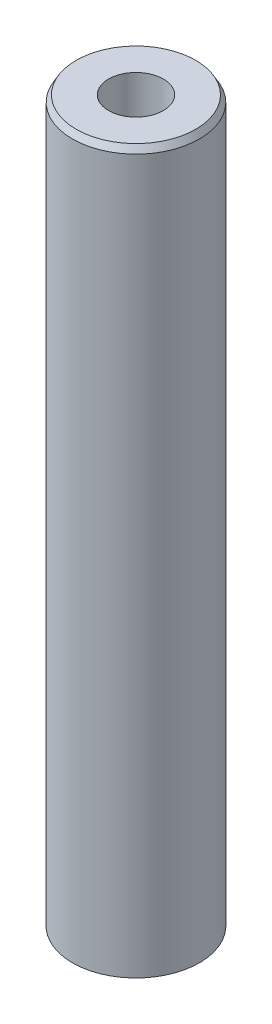
ISO-10303-21;
HEADER;
FILE_DESCRIPTION(('STEP AP214'),'2;1');
FILE_NAME('part.step','',(''),(''),'','','');
FILE_SCHEMA(('AUTOMOTIVE_DESIGN { 1 0 10303 214 1 1 1 1 }'));
ENDSEC;
DATA;
#1=APPLICATION_CONTEXT('core data for automotive mechanical design processes');
#2=APPLICATION_PROTOCOL_DEFINITION('international standard','automotive_design',2000,#1);
#3=PRODUCT_CONTEXT('',#1,'mechanical');
#4=PRODUCT('Part','Part','',(#3));
#5=PRODUCT_RELATED_PRODUCT_CATEGORY('part','',(#4));
#6=PRODUCT_DEFINITION_FORMATION('','',#4);
#7=PRODUCT_DEFINITION_CONTEXT('part definition',#1,'design');
#8=PRODUCT_DEFINITION('design','',#6,#7);
#9=PRODUCT_DEFINITION_SHAPE('','',#8);
#10=(LENGTH_UNIT() NAMED_UNIT(*) SI_UNIT(.MILLI.,.METRE.));
#11=(NAMED_UNIT(*) PLANE_ANGLE_UNIT() SI_UNIT($,.RADIAN.));
#12=(NAMED_UNIT(*) SI_UNIT($,.STERADIAN.) SOLID_ANGLE_UNIT());
#13=UNCERTAINTY_MEASURE_WITH_UNIT(LENGTH_MEASURE(1.E-05),#10,'distance_accuracy_value','');
#14=(GEOMETRIC_REPRESENTATION_CONTEXT(3) GLOBAL_UNCERTAINTY_ASSIGNED_CONTEXT((#13)) GLOBAL_UNIT_ASSIGNED_CONTEXT((#10,
#11,#12)) REPRESENTATION_CONTEXT('',''));
#15=CARTESIAN_POINT('',(0.,0.,0.));
#16=DIRECTION('',(0.,0.,1.));
#17=DIRECTION('',(1.,0.,0.));
#18=AXIS2_PLACEMENT_3D('',#15,#16,#17);
#19=CARTESIAN_POINT('',(0.,541.152869145942,0.));
#20=DIRECTION('',(0.,-1.,0.));
#21=DIRECTION('',(0.,0.,-1.));
#22=AXIS2_PLACEMENT_3D('',#19,#20,#21);
#23=CYLINDRICAL_SURFACE('',#22,47.5);
#24=CARTESIAN_POINT('',(0.,536.290267975968,0.));
#25=DIRECTION('',(0.,1.,0.));
#26=DIRECTION('',(0.,0.,1.));
#27=AXIS2_PLACEMENT_3D('',#24,#25,#26);
#28=CIRCLE('',#27,47.5);
#29=CARTESIAN_POINT('',(0.,536.290267975968,47.5));
#30=VERTEX_POINT('',#29);
#31=EDGE_CURVE('E50',#30,#30,#28,.F.);
#32=ORIENTED_EDGE('',*,*,#31,.T.);
#33=EDGE_LOOP('',(#32));
#34=FACE_BOUND('',#33,.T.);
#35=CARTESIAN_POINT('',(0.,2.80742409444645,0.));
#36=DIRECTION('',(0.,1.,0.));
#37=DIRECTION('',(0.,0.,1.));
#38=AXIS2_PLACEMENT_3D('',#35,#36,#37);
#39=CIRCLE('',#38,47.5);
#40=CARTESIAN_POINT('',(0.,2.80742409444645,47.5));
#41=VERTEX_POINT('',#40);
#42=EDGE_CURVE('E51',#41,#41,#39,.T.);
#43=ORIENTED_EDGE('',*,*,#42,.T.);
#44=EDGE_LOOP('',(#43));
#45=FACE_BOUND('',#44,.T.);
#46=ADVANCED_FACE('F39',(#34,#45),#23,.T.);
#47=CARTESIAN_POINT('',(0.,541.152869145942,0.));
#48=DIRECTION('',(0.,1.,0.));
#49=DIRECTION('',(0.,0.,1.));
#50=AXIS2_PLACEMENT_3D('',#47,#48,#49);
#51=PLANE('',#50);
#52=CARTESIAN_POINT('',(0.,541.152869145942,0.));
#53=DIRECTION('',(0.,1.,0.));
#54=DIRECTION('',(0.,0.,1.));
#55=AXIS2_PLACEMENT_3D('',#52,#53,#54);
#56=CIRCLE('',#55,44.6925759055537);
#57=CARTESIAN_POINT('',(0.,541.152869145942,44.6925759055537));
#58=VERTEX_POINT('',#57);
#59=EDGE_CURVE('E54',#58,#58,#56,.T.);
#60=ORIENTED_EDGE('',*,*,#59,.T.);
#61=EDGE_LOOP('',(#60));
#62=FACE_BOUND('',#61,.T.);
#63=CARTESIAN_POINT('',(0.,541.152869145942,0.));
#64=DIRECTION('',(0.,1.,0.));
#65=DIRECTION('',(0.,0.,1.));
#66=AXIS2_PLACEMENT_3D('',#63,#64,#65);
#67=CIRCLE('',#66,20.4709767504483);
#68=CARTESIAN_POINT('',(0.,541.152869145942,20.4709767504483));
#69=VERTEX_POINT('',#68);
#70=EDGE_CURVE('E58',#69,#69,#67,.T.);
#71=ORIENTED_EDGE('',*,*,#70,.F.);
#72=EDGE_LOOP('',(#71));
#73=FACE_BOUND('',#72,.T.);
#74=ADVANCED_FACE('F69',(#62,#73),#51,.T.);
#75=CARTESIAN_POINT('',(0.,0.,0.));
#76=DIRECTION('',(0.,1.,0.));
#77=DIRECTION('',(0.,0.,1.));
#78=AXIS2_PLACEMENT_3D('',#75,#76,#77);
#79=PLANE('',#78);
#80=CARTESIAN_POINT('',(0.,0.,0.));
#81=DIRECTION('',(0.,1.,0.));
#82=DIRECTION('',(0.,0.,1.));
#83=AXIS2_PLACEMENT_3D('',#80,#81,#82);
#84=CIRCLE('',#83,42.6373988300258);
#85=CARTESIAN_POINT('',(0.,0.,42.6373988300258));
#86=VERTEX_POINT('',#85);
#87=EDGE_CURVE('E10',#86,#86,#84,.F.);
#88=ORIENTED_EDGE('',*,*,#87,.T.);
#89=EDGE_LOOP('',(#88));
#90=FACE_BOUND('',#89,.T.);
#91=CARTESIAN_POINT('',(0.,0.,0.));
#92=DIRECTION('',(0.,1.,0.));
#93=DIRECTION('',(0.,0.,1.));
#94=AXIS2_PLACEMENT_3D('',#91,#92,#93);
#95=CIRCLE('',#94,20.4709767504483);
#96=CARTESIAN_POINT('',(0.,0.,20.4709767504483));
#97=VERTEX_POINT('',#96);
#98=EDGE_CURVE('E63',#97,#97,#95,.T.);
#99=ORIENTED_EDGE('',*,*,#98,.T.);
#100=EDGE_LOOP('',(#99));
#101=FACE_BOUND('',#100,.T.);
#102=ADVANCED_FACE('F75',(#90,#101),#79,.F.);
#103=CARTESIAN_POINT('',(0.,541.152869145942,0.));
#104=DIRECTION('',(0.,-1.,0.));
#105=DIRECTION('',(0.,0.,-1.));
#106=AXIS2_PLACEMENT_3D('',#103,#104,#105);
#107=CYLINDRICAL_SURFACE('',#106,20.4709767504483);
#108=ORIENTED_EDGE('',*,*,#70,.T.);
#109=EDGE_LOOP('',(#108));
#110=FACE_BOUND('',#109,.T.);
#111=ORIENTED_EDGE('',*,*,#98,.F.);
#112=EDGE_LOOP('',(#111));
#113=FACE_BOUND('',#112,.T.);
#114=ADVANCED_FACE('F70',(#110,#113),#107,.F.);
#115=CARTESIAN_POINT('',(0.,541.152869145942,0.));
#116=DIRECTION('',(0.,-1.,0.));
#117=DIRECTION('',(0.,0.,-1.));
#118=AXIS2_PLACEMENT_3D('',#115,#116,#117);
#119=CONICAL_SURFACE('',#118,44.6925759055537,0.523598775598298);
#120=ORIENTED_EDGE('',*,*,#31,.F.);
#121=EDGE_LOOP('',(#120));
#122=FACE_BOUND('',#121,.T.);
#123=ORIENTED_EDGE('',*,*,#59,.F.);
#124=EDGE_LOOP('',(#123));
#125=FACE_BOUND('',#124,.T.);
#126=ADVANCED_FACE('F81',(#122,#125),#119,.T.);
#127=CARTESIAN_POINT('',(0.,2.80742409444645,0.));
#128=DIRECTION('',(0.,1.,0.));
#129=DIRECTION('',(0.,0.,1.));
#130=AXIS2_PLACEMENT_3D('',#127,#128,#129);
#131=CONICAL_SURFACE('',#130,47.5,1.04719755119659);
#132=CARTESIAN_POINT('',(0.,0.,42.6373988300258));
#133=CARTESIAN_POINT('',(0.,0.0292440009838161,42.6880509255463));
#134=CARTESIAN_POINT('',(0.,0.0584880019676337,42.7387030210669));
#135=CARTESIAN_POINT('',(0.,0.116976003935269,42.840007212108));
#136=CARTESIAN_POINT('',(0.,0.146220004919086,42.8906593076286));
#137=CARTESIAN_POINT('',(0.,0.20470800688672,42.9919634986697));
#138=CARTESIAN_POINT('',(0.,0.233952007870537,43.0426155941903));
#139=CARTESIAN_POINT('',(0.,0.292440009838171,43.1439197852314));
#140=CARTESIAN_POINT('',(0.,0.321684010821989,43.194571880752));
#141=CARTESIAN_POINT('',(0.,0.380172012789624,43.2958760717931));
#142=CARTESIAN_POINT('',(0.,0.409416013773441,43.3465281673137));
#143=CARTESIAN_POINT('',(0.,0.467904015741075,43.4478323583548));
#144=CARTESIAN_POINT('',(0.,0.497148016724892,43.4984844538754));
#145=CARTESIAN_POINT('',(0.,0.555636018692526,43.5997886449165));
#146=CARTESIAN_POINT('',(0.,0.584880019676345,43.6504407404371));
#147=CARTESIAN_POINT('',(0.,0.643368021643979,43.7517449314782));
#148=CARTESIAN_POINT('',(0.,0.672612022627795,43.8023970269988));
#149=CARTESIAN_POINT('',(0.,0.731100024595429,43.9037012180399));
#150=CARTESIAN_POINT('',(0.,0.760344025579247,43.9543533135605));
#151=CARTESIAN_POINT('',(0.,0.818832027546882,44.0556575046016));
#152=CARTESIAN_POINT('',(0.,0.8480760285307,44.1063096001222));
#153=CARTESIAN_POINT('',(0.,0.906564030498334,44.2076137911633));
#154=CARTESIAN_POINT('',(0.,0.93580803148215,44.2582658866838));
#155=CARTESIAN_POINT('',(0.,0.994296033449784,44.359570077725));
#156=CARTESIAN_POINT('',(0.,1.0235400344336,44.4102221732455));
#157=CARTESIAN_POINT('',(0.,1.08202803640124,44.5115263642867));
#158=CARTESIAN_POINT('',(0.,1.11127203738505,44.5621784598072));
#159=CARTESIAN_POINT('',(0.,1.16976003935269,44.6634826508484));
#160=CARTESIAN_POINT('',(0.,1.19900404033651,44.7141347463689));
#161=CARTESIAN_POINT('',(0.,1.25749204230414,44.8154389374101));
#162=CARTESIAN_POINT('',(0.,1.28673604328796,44.8660910329306));
#163=CARTESIAN_POINT('',(0.,1.34522404525559,44.9673952239717));
#164=CARTESIAN_POINT('',(0.,1.37446804623941,45.0180473194923));
#165=CARTESIAN_POINT('',(0.,1.43295604820704,45.1193515105334));
#166=CARTESIAN_POINT('',(0.,1.46220004919086,45.170003606054));
#167=CARTESIAN_POINT('',(0.,1.52068805115849,45.2713077970951));
#168=CARTESIAN_POINT('',(0.,1.54993205214231,45.3219598926157));
#169=CARTESIAN_POINT('',(0.,1.60842005410995,45.4232640836568));
#170=CARTESIAN_POINT('',(0.,1.63766405509376,45.4739161791774));
#171=CARTESIAN_POINT('',(0.,1.6961520570614,45.5752203702185));
#172=CARTESIAN_POINT('',(0.,1.72539605804522,45.6258724657391));
#173=CARTESIAN_POINT('',(0.,1.78388406001285,45.7271766567802));
#174=CARTESIAN_POINT('',(0.,1.81312806099667,45.7778287523008));
#175=CARTESIAN_POINT('',(0.,1.8716160629643,45.8791329433419));
#176=CARTESIAN_POINT('',(0.,1.90086006394812,45.9297850388625));
#177=CARTESIAN_POINT('',(0.,1.95934806591575,46.0310892299036));
#178=CARTESIAN_POINT('',(0.,1.98859206689957,46.0817413254242));
#179=CARTESIAN_POINT('',(0.,2.0470800688672,46.1830455164653));
#180=CARTESIAN_POINT('',(0.,2.07632406985102,46.2336976119859));
#181=CARTESIAN_POINT('',(0.,2.13481207181866,46.335001803027));
#182=CARTESIAN_POINT('',(0.,2.16405607280247,46.3856538985476));
#183=CARTESIAN_POINT('',(0.,2.22254407477011,46.4869580895887));
#184=CARTESIAN_POINT('',(0.,2.25178807575393,46.5376101851093));
#185=CARTESIAN_POINT('',(0.,2.31027607772156,46.6389143761504));
#186=CARTESIAN_POINT('',(0.,2.33952007870538,46.689566471671));
#187=CARTESIAN_POINT('',(0.,2.39800808067301,46.7908706627121));
#188=CARTESIAN_POINT('',(0.,2.42725208165683,46.8415227582327));
#189=CARTESIAN_POINT('',(0.,2.48574008362446,46.9428269492738));
#190=CARTESIAN_POINT('',(0.,2.51498408460828,46.9934790447944));
#191=CARTESIAN_POINT('',(0.,2.57347208657592,47.0947832358355));
#192=CARTESIAN_POINT('',(0.,2.60271608755973,47.1454353313561));
#193=CARTESIAN_POINT('',(0.,2.66120408952737,47.2467395223972));
#194=CARTESIAN_POINT('',(0.,2.69044809051118,47.2973916179177));
#195=CARTESIAN_POINT('',(0.,2.74893609247882,47.3986958089589));
#196=CARTESIAN_POINT('',(0.,2.77818009346263,47.4493479044794));
#197=CARTESIAN_POINT('',(0.,2.80742409444645,47.5));
#198=B_SPLINE_CURVE_WITH_KNOTS('',3,(#132,#133,#134,#135,#136,#137,#138,#139,#140,#141,#142,
#143,#144,#145,#146,#147,#148,#149,#150,#151,#152,#153,#154,#155,#156,#157,#158,#159,#160,#161,
#162,#163,#164,#165,#166,#167,#168,#169,#170,#171,#172,#173,#174,#175,#176,#177,#178,#179,#180,
#181,#182,#183,#184,#185,#186,#187,#188,#189,#190,#191,#192,#193,#194,#195,#196,#197),
.UNSPECIFIED.,.F.,.F.,(4,2,2,2,2,2,2,2,2,2,2,2,2,2,2,2,2,2,2,2,2,2,2,2,2,2,2,2,2,2,2,2,4),(0.,
0.1754640059029,0.350928011805799,0.526392017708705,0.701856023611605,0.877320029514504,
1.05278403541741,1.22824804132031,1.40371204722322,1.57917605312612,1.75464005902901,
1.93010406493192,2.10556807083482,2.28103207673772,2.45649608264063,2.63196008854352,
2.80742409444643,2.98288810034933,3.15835210625223,3.33381611215513,3.50928011805804,
3.68474412396093,3.86020812986383,4.03567213576674,4.21113614166964,4.38660014757255,
4.56206415347545,4.73752815937835,4.91299216528125,5.08845617118415,5.26392017708705,
5.43938418298996,5.61484818889286),.UNSPECIFIED.);
#199=EDGE_CURVE('BSEAM45',#86,#41,#198,.T.);
#200=ORIENTED_EDGE('',*,*,#87,.F.);
#201=ORIENTED_EDGE('',*,*,#42,.F.);
#202=ORIENTED_EDGE('',*,*,#199,.T.);
#203=ORIENTED_EDGE('',*,*,#199,.F.);
#204=EDGE_LOOP('',(#200,#202,#201,#203));
#205=FACE_BOUND('',#204,.T.);
#206=ADVANCED_FACE('F45',(#205),#131,.T.);
#207=CLOSED_SHELL('',(#46,#74,#102,#114,#126,#206));
#208=MANIFOLD_SOLID_BREP('B2',#207);
#209=ADVANCED_BREP_SHAPE_REPRESENTATION('',(#18,#208),#14);
#210=SHAPE_DEFINITION_REPRESENTATION(#9,#209);
ENDSEC;
END-ISO-10303-21;
